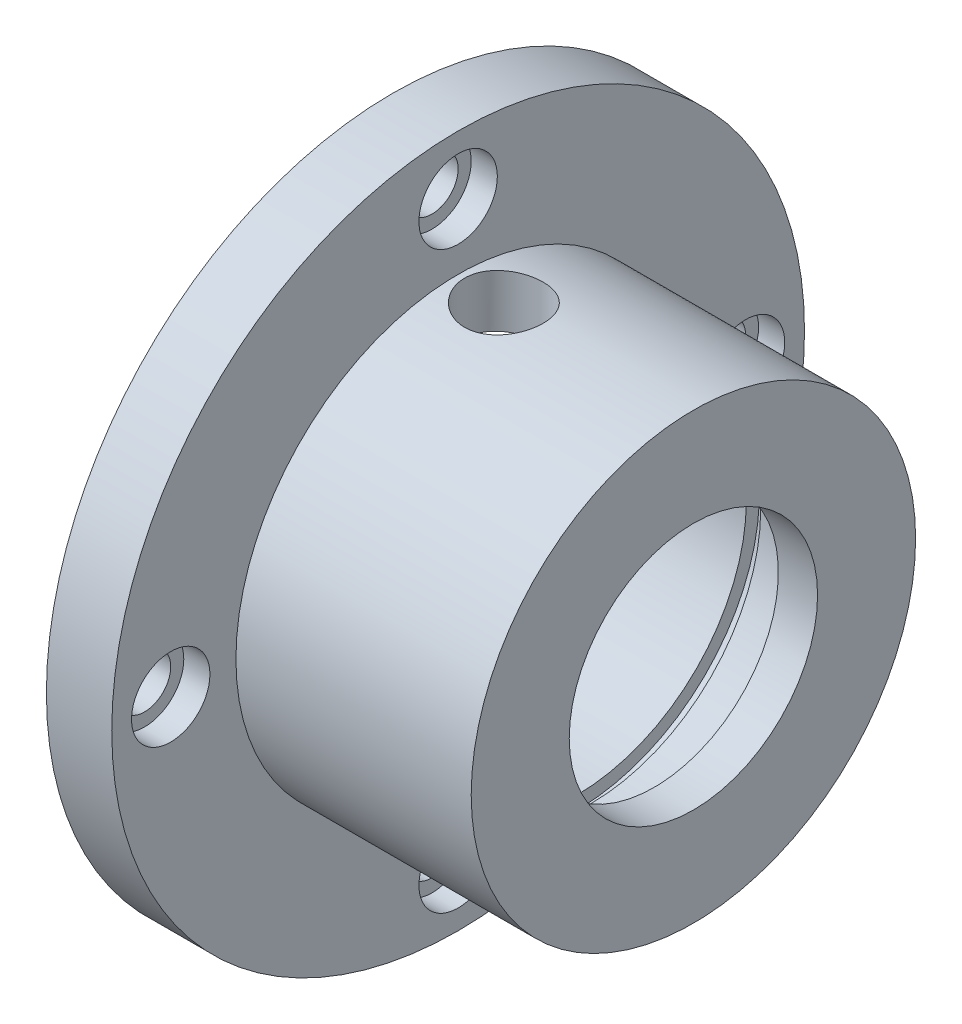
ISO-10303-21;
HEADER;
FILE_DESCRIPTION(('STEP AP214'),'2;1');
FILE_NAME('part.step','',(''),(''),'','','');
FILE_SCHEMA(('AUTOMOTIVE_DESIGN { 1 0 10303 214 1 1 1 1 }'));
ENDSEC;
DATA;
#1=APPLICATION_CONTEXT('core data for automotive mechanical design processes');
#2=APPLICATION_PROTOCOL_DEFINITION('international standard','automotive_design',2000,#1);
#3=PRODUCT_CONTEXT('',#1,'mechanical');
#4=PRODUCT('Part','Part','',(#3));
#5=PRODUCT_RELATED_PRODUCT_CATEGORY('part','',(#4));
#6=PRODUCT_DEFINITION_FORMATION('','',#4);
#7=PRODUCT_DEFINITION_CONTEXT('part definition',#1,'design');
#8=PRODUCT_DEFINITION('design','',#6,#7);
#9=PRODUCT_DEFINITION_SHAPE('','',#8);
#10=(LENGTH_UNIT() NAMED_UNIT(*) SI_UNIT(.MILLI.,.METRE.));
#11=(NAMED_UNIT(*) PLANE_ANGLE_UNIT() SI_UNIT($,.RADIAN.));
#12=(NAMED_UNIT(*) SI_UNIT($,.STERADIAN.) SOLID_ANGLE_UNIT());
#13=UNCERTAINTY_MEASURE_WITH_UNIT(LENGTH_MEASURE(1.E-05),#10,'distance_accuracy_value','');
#14=(GEOMETRIC_REPRESENTATION_CONTEXT(3) GLOBAL_UNCERTAINTY_ASSIGNED_CONTEXT((#13)) GLOBAL_UNIT_ASSIGNED_CONTEXT((#10,
#11,#12)) REPRESENTATION_CONTEXT('',''));
#15=CARTESIAN_POINT('',(0.,0.,0.));
#16=DIRECTION('',(0.,0.,1.));
#17=DIRECTION('',(1.,0.,0.));
#18=AXIS2_PLACEMENT_3D('',#15,#16,#17);
#19=CARTESIAN_POINT('',(11.5,-21.9876704063217,0.));
#20=DIRECTION('',(-1.,0.,0.));
#21=DIRECTION('',(0.,0.,1.));
#22=AXIS2_PLACEMENT_3D('',#19,#20,#21);
#23=CYLINDRICAL_SURFACE('',#22,2.);
#24=CARTESIAN_POINT('',(-11.5,-21.9876704063217,0.));
#25=DIRECTION('',(1.,0.,0.));
#26=DIRECTION('',(0.,0.,-1.));
#27=AXIS2_PLACEMENT_3D('',#24,#25,#26);
#28=CIRCLE('',#27,2.);
#29=CARTESIAN_POINT('',(-11.5,-21.9876704063217,-2.));
#30=VERTEX_POINT('',#29);
#31=EDGE_CURVE('E180',#30,#30,#28,.T.);
#32=ORIENTED_EDGE('',*,*,#31,.F.);
#33=EDGE_LOOP('',(#32));
#34=FACE_BOUND('',#33,.T.);
#35=CARTESIAN_POINT('',(-8.5,-21.9876704063217,0.));
#36=DIRECTION('',(1.,0.,0.));
#37=DIRECTION('',(0.,0.,-1.));
#38=AXIS2_PLACEMENT_3D('',#35,#36,#37);
#39=CIRCLE('',#38,2.);
#40=CARTESIAN_POINT('',(-8.5,-21.9876704063217,-2.));
#41=VERTEX_POINT('',#40);
#42=EDGE_CURVE('E175',#41,#41,#39,.T.);
#43=ORIENTED_EDGE('',*,*,#42,.T.);
#44=EDGE_LOOP('',(#43));
#45=FACE_BOUND('',#44,.T.);
#46=ADVANCED_FACE('F171',(#34,#45),#23,.F.);
#47=CARTESIAN_POINT('',(11.5,0.,21.9876704063218));
#48=DIRECTION('',(-1.,0.,0.));
#49=DIRECTION('',(0.,0.,1.));
#50=AXIS2_PLACEMENT_3D('',#47,#48,#49);
#51=CYLINDRICAL_SURFACE('',#50,2.);
#52=CARTESIAN_POINT('',(-11.5,0.,21.9876704063218));
#53=DIRECTION('',(1.,0.,0.));
#54=DIRECTION('',(0.,0.,-1.));
#55=AXIS2_PLACEMENT_3D('',#52,#53,#54);
#56=CIRCLE('',#55,2.);
#57=CARTESIAN_POINT('',(-11.5,0.,19.9876704063218));
#58=VERTEX_POINT('',#57);
#59=EDGE_CURVE('E187',#58,#58,#56,.T.);
#60=ORIENTED_EDGE('',*,*,#59,.F.);
#61=EDGE_LOOP('',(#60));
#62=FACE_BOUND('',#61,.T.);
#63=CARTESIAN_POINT('',(-8.5,0.,21.9876704063218));
#64=DIRECTION('',(1.,0.,0.));
#65=DIRECTION('',(0.,0.,-1.));
#66=AXIS2_PLACEMENT_3D('',#63,#64,#65);
#67=CIRCLE('',#66,2.);
#68=CARTESIAN_POINT('',(-8.5,0.,19.9876704063218));
#69=VERTEX_POINT('',#68);
#70=EDGE_CURVE('E666',#69,#69,#67,.T.);
#71=ORIENTED_EDGE('',*,*,#70,.T.);
#72=EDGE_LOOP('',(#71));
#73=FACE_BOUND('',#72,.T.);
#74=ADVANCED_FACE('F260',(#62,#73),#51,.F.);
#75=CARTESIAN_POINT('',(11.5,21.9876704063218,0.));
#76=DIRECTION('',(-1.,0.,0.));
#77=DIRECTION('',(0.,0.,1.));
#78=AXIS2_PLACEMENT_3D('',#75,#76,#77);
#79=CYLINDRICAL_SURFACE('',#78,2.);
#80=CARTESIAN_POINT('',(-11.5,21.9876704063218,0.));
#81=DIRECTION('',(1.,0.,0.));
#82=DIRECTION('',(0.,0.,-1.));
#83=AXIS2_PLACEMENT_3D('',#80,#81,#82);
#84=CIRCLE('',#83,2.);
#85=CARTESIAN_POINT('',(-11.5,21.9876704063218,-2.));
#86=VERTEX_POINT('',#85);
#87=EDGE_CURVE('E293',#86,#86,#84,.T.);
#88=ORIENTED_EDGE('',*,*,#87,.F.);
#89=EDGE_LOOP('',(#88));
#90=FACE_BOUND('',#89,.T.);
#91=CARTESIAN_POINT('',(-8.5,21.9876704063218,0.));
#92=DIRECTION('',(1.,0.,0.));
#93=DIRECTION('',(0.,0.,-1.));
#94=AXIS2_PLACEMENT_3D('',#91,#92,#93);
#95=CIRCLE('',#94,2.);
#96=CARTESIAN_POINT('',(-8.5,21.9876704063218,-2.));
#97=VERTEX_POINT('',#96);
#98=EDGE_CURVE('E596',#97,#97,#95,.T.);
#99=ORIENTED_EDGE('',*,*,#98,.T.);
#100=EDGE_LOOP('',(#99));
#101=FACE_BOUND('',#100,.T.);
#102=ADVANCED_FACE('F256',(#90,#101),#79,.F.);
#103=CARTESIAN_POINT('',(11.5,0.,-21.9876704063218));
#104=DIRECTION('',(-1.,0.,0.));
#105=DIRECTION('',(0.,0.,1.));
#106=AXIS2_PLACEMENT_3D('',#103,#104,#105);
#107=CYLINDRICAL_SURFACE('',#106,2.);
#108=CARTESIAN_POINT('',(-11.5,0.,-21.9876704063218));
#109=DIRECTION('',(1.,0.,0.));
#110=DIRECTION('',(0.,0.,-1.));
#111=AXIS2_PLACEMENT_3D('',#108,#109,#110);
#112=CIRCLE('',#111,2.);
#113=CARTESIAN_POINT('',(-11.5,0.,-23.9876704063218));
#114=VERTEX_POINT('',#113);
#115=EDGE_CURVE('E296',#114,#114,#112,.T.);
#116=ORIENTED_EDGE('',*,*,#115,.F.);
#117=EDGE_LOOP('',(#116));
#118=FACE_BOUND('',#117,.T.);
#119=CARTESIAN_POINT('',(-8.5,0.,-21.9876704063218));
#120=DIRECTION('',(1.,0.,0.));
#121=DIRECTION('',(0.,0.,-1.));
#122=AXIS2_PLACEMENT_3D('',#119,#120,#121);
#123=CIRCLE('',#122,2.);
#124=CARTESIAN_POINT('',(-8.5,0.,-23.9876704063218));
#125=VERTEX_POINT('',#124);
#126=EDGE_CURVE('E216',#125,#125,#123,.T.);
#127=ORIENTED_EDGE('',*,*,#126,.T.);
#128=EDGE_LOOP('',(#127));
#129=FACE_BOUND('',#128,.T.);
#130=ADVANCED_FACE('F251',(#118,#129),#107,.F.);
#131=CARTESIAN_POINT('',(-6.5,0.,0.));
#132=DIRECTION('',(1.,0.,0.));
#133=DIRECTION('',(0.,0.,-1.));
#134=AXIS2_PLACEMENT_3D('',#131,#132,#133);
#135=CYLINDRICAL_SURFACE('',#134,17.);
#136=CARTESIAN_POINT('',(11.5,0.,0.));
#137=DIRECTION('',(1.,0.,0.));
#138=DIRECTION('',(0.,0.,-1.));
#139=AXIS2_PLACEMENT_3D('',#136,#137,#138);
#140=CIRCLE('',#139,17.);
#141=CARTESIAN_POINT('',(11.5,0.,-17.));
#142=VERTEX_POINT('',#141);
#143=EDGE_CURVE('E308',#142,#142,#140,.T.);
#144=ORIENTED_EDGE('',*,*,#143,.F.);
#145=EDGE_LOOP('',(#144));
#146=FACE_BOUND('',#145,.T.);
#147=CARTESIAN_POINT('',(-6.5,0.,0.));
#148=DIRECTION('',(1.,0.,0.));
#149=DIRECTION('',(0.,0.,-1.));
#150=AXIS2_PLACEMENT_3D('',#147,#148,#149);
#151=CIRCLE('',#150,17.);
#152=CARTESIAN_POINT('',(-6.5,0.,-17.));
#153=VERTEX_POINT('',#152);
#154=EDGE_CURVE('E305',#153,#153,#151,.T.);
#155=ORIENTED_EDGE('',*,*,#154,.T.);
#156=EDGE_LOOP('',(#155));
#157=FACE_BOUND('',#156,.T.);
#158=CARTESIAN_POINT('',(-3.,16.7332005306815,-3.));
#159=CARTESIAN_POINT('',(-2.83290242517745,16.733203659137,-2.99999341706779));
#160=CARTESIAN_POINT('',(-2.66571728359335,16.7357306336792,-2.98599188006115));
#161=CARTESIAN_POINT('',(-2.33604853853598,16.7455547560881,-2.93038611619624));
#162=CARTESIAN_POINT('',(-2.17356924605811,16.7528561418772,-2.88875736603643));
#163=CARTESIAN_POINT('',(-1.85813046315929,16.7713769744464,-2.77920470143951));
#164=CARTESIAN_POINT('',(-1.70516273825064,16.7825929749641,-2.71130391011432));
#165=CARTESIAN_POINT('',(-1.41280390580784,16.8076752031184,-2.55119395060397));
#166=CARTESIAN_POINT('',(-1.27341148708122,16.8215411744195,-2.45898713324998));
#167=CARTESIAN_POINT('',(-1.01060791050012,16.8505319667316,-2.25179739075806));
#168=CARTESIAN_POINT('',(-0.887368331806502,16.8656678757378,-2.13659835160851));
#169=CARTESIAN_POINT('',(-0.661861174170796,16.8953948741519,-1.88716133428236));
#170=CARTESIAN_POINT('',(-0.559594898043314,16.9099859296687,-1.7529221742517));
#171=CARTESIAN_POINT('',(-0.378287035302201,16.9370972325124,-1.46809659328413));
#172=CARTESIAN_POINT('',(-0.299406108837018,16.9496029076749,-1.31740639730191));
#173=CARTESIAN_POINT('',(-0.168141843225435,16.9710106727515,-1.0046561208221));
#174=CARTESIAN_POINT('',(-0.11575657406108,16.9799130251322,-0.842596869457892));
#175=CARTESIAN_POINT('',(-0.0394981276670255,16.9930327949023,-0.51348405487888));
#176=CARTESIAN_POINT('',(-0.0153361926544865,16.99729762782,-0.346499320678272));
#177=CARTESIAN_POINT('',(0.00468845854208651,17.0008249757298,-0.0107952857006706));
#178=CARTESIAN_POINT('',(0.00055332042626999,17.0000878700071,0.157923882589586));
#179=CARTESIAN_POINT('',(-0.035675306623233,16.9937317070067,0.490330439822313));
#180=CARTESIAN_POINT('',(-0.06745796453603,16.9881669273875,0.654052892885598));
#181=CARTESIAN_POINT('',(-0.157589006441779,16.9728413393235,0.97380383078362));
#182=CARTESIAN_POINT('',(-0.215938274329761,16.9630803912691,1.12983205943314));
#183=CARTESIAN_POINT('',(-0.357849279757668,16.9403675397274,1.43067945594811));
#184=CARTESIAN_POINT('',(-0.441537345358246,16.9273997089122,1.57543778282086));
#185=CARTESIAN_POINT('',(-0.631657563585156,16.8997108448691,1.84897334841093));
#186=CARTESIAN_POINT('',(-0.738091773558185,16.8849896531063,1.97774913987089));
#187=CARTESIAN_POINT('',(-0.972401978770558,16.8551920631541,2.21750308120658));
#188=CARTESIAN_POINT('',(-1.10054977994146,16.8401135567061,2.32821549831622));
#189=CARTESIAN_POINT('',(-1.37373847473942,16.8114932894814,2.52661268493801));
#190=CARTESIAN_POINT('',(-1.51877956304375,16.7979515464179,2.61429718903989));
#191=CARTESIAN_POINT('',(-1.82196590926801,16.7739360187751,2.76421240007642));
#192=CARTESIAN_POINT('',(-1.98012883323353,16.763466459187,2.82640809993052));
#193=CARTESIAN_POINT('',(-2.30488439069899,16.7468480678056,2.923271922403));
#194=CARTESIAN_POINT('',(-2.47147618397034,16.7406988062511,2.95794278309596));
#195=CARTESIAN_POINT('',(-2.80597444721306,16.7335012949974,2.99839229030452));
#196=CARTESIAN_POINT('',(-2.97383354662812,16.732385932103,3.00455109542123));
#197=CARTESIAN_POINT('',(-3.30818284539117,16.735203364457,2.988817469486));
#198=CARTESIAN_POINT('',(-3.47467310401107,16.7391359399547,2.9669262595295));
#199=CARTESIAN_POINT('',(-3.80033188093181,16.7515439079533,2.89603917366235));
#200=CARTESIAN_POINT('',(-3.95954445821164,16.7599864132377,2.84723943756168));
#201=CARTESIAN_POINT('',(-4.26753258967659,16.7804350541278,2.72412734478129));
#202=CARTESIAN_POINT('',(-4.41630745160447,16.7924414258231,2.64981329784697));
#203=CARTESIAN_POINT('',(-4.70088108970731,16.8188195101243,2.47689505257512));
#204=CARTESIAN_POINT('',(-4.83653061780971,16.8332142870081,2.37804881804717));
#205=CARTESIAN_POINT('',(-5.08945442639291,16.8626809908302,2.15920160851684));
#206=CARTESIAN_POINT('',(-5.20672724975834,16.8777529713432,2.03919895759332));
#207=CARTESIAN_POINT('',(-5.42097151754292,16.9070896901565,1.77975481037973));
#208=CARTESIAN_POINT('',(-5.51768844803103,16.9213428734784,1.64010163284743));
#209=CARTESIAN_POINT('',(-5.68628661620563,16.9472466525071,1.3463081734332));
#210=CARTESIAN_POINT('',(-5.7581687299371,16.9588973400115,1.19216840280802));
#211=CARTESIAN_POINT('',(-5.87466757528012,16.9782334307841,0.874509086642462));
#212=CARTESIAN_POINT('',(-5.91941373570498,16.9859376296005,0.711038201693319));
#213=CARTESIAN_POINT('',(-5.98078566857961,16.9965924853723,0.378753976094074));
#214=CARTESIAN_POINT('',(-5.99741404793107,16.9995435830037,0.209941132194942));
#215=CARTESIAN_POINT('',(-6.00199617685697,17.0003523424479,-0.125785797667699));
#216=CARTESIAN_POINT('',(-5.99033585470446,16.998278556654,-0.292694575575972));
#217=CARTESIAN_POINT('',(-5.93951111217844,16.9894116421764,-0.6221359821573));
#218=CARTESIAN_POINT('',(-5.90034689340248,16.9826185480842,-0.784668642897266));
#219=CARTESIAN_POINT('',(-5.7957809492101,16.965074633354,-1.10057077006559));
#220=CARTESIAN_POINT('',(-5.73041583804355,16.9543293374119,-1.25395268193512));
#221=CARTESIAN_POINT('',(-5.57534797368827,16.9300495065003,-1.54763086574851));
#222=CARTESIAN_POINT('',(-5.48564384478414,16.916514813876,-1.68792639740778));
#223=CARTESIAN_POINT('',(-5.28309416335656,16.8879355033809,-1.95338412231491));
#224=CARTESIAN_POINT('',(-5.16996767677077,16.8728738083157,-2.07833014278401));
#225=CARTESIAN_POINT('',(-4.92437146490511,16.8430514055019,-2.30760043049162));
#226=CARTESIAN_POINT('',(-4.79189721104744,16.8282907691441,-2.41191985633483));
#227=CARTESIAN_POINT('',(-4.51009515247276,16.8006127610803,-2.59775561790147));
#228=CARTESIAN_POINT('',(-4.36064031467871,16.7877111766405,-2.67908171730508));
#229=CARTESIAN_POINT('',(-4.05001730240621,16.7654000051509,-2.81534545371831));
#230=CARTESIAN_POINT('',(-3.8888607139775,16.7559870188903,-2.87030879344953));
#231=CARTESIAN_POINT('',(-3.60595283314428,16.743749817072,-2.94069751613137));
#232=CARTESIAN_POINT('',(-3.48588988570537,16.7398165049557,-2.96289917401039));
#233=CARTESIAN_POINT('',(-3.24390015090383,16.7345407484587,-2.9925526562456));
#234=CARTESIAN_POINT('',(-3.12197340462215,16.7331982470555,-3.00000480523225));
#235=CARTESIAN_POINT('',(-3.,16.7332005306815,-3.));
#236=B_SPLINE_CURVE_WITH_KNOTS('',3,(#158,#159,#160,#161,#162,#163,#164,#165,#166,#167,#168,
#169,#170,#171,#172,#173,#174,#175,#176,#177,#178,#179,#180,#181,#182,#183,#184,#185,#186,#187,
#188,#189,#190,#191,#192,#193,#194,#195,#196,#197,#198,#199,#200,#201,#202,#203,#204,#205,#206,
#207,#208,#209,#210,#211,#212,#213,#214,#215,#216,#217,#218,#219,#220,#221,#222,#223,#224,#225,
#226,#227,#228,#229,#230,#231,#232,#233,#234,#235),.UNSPECIFIED.,.T.,.F.,(4,2,2,2,2,2,2,2,2,2,2,
2,2,2,2,2,2,2,2,2,2,2,2,2,2,2,2,2,2,2,2,2,2,2,2,2,2,2,4),(0.,0.500846543953231,1.00213826013799,
1.50298976868477,2.00379285361821,2.50954594710764,3.01533044733788,3.52451324479758,
4.03365894661123,4.53754855435206,5.04139995375876,5.53965889297026,6.03793441091674,
6.53873619993847,7.0395833047412,7.54723879028646,8.05490012660333,8.56325638208416,
9.07156206172708,9.57307047019078,10.0745570473354,10.5724356393645,11.07034722088,
11.5733814202243,12.0764554857135,12.5854359093522,13.0943983769382,13.6009137808448,
14.107382221292,14.6069801177485,15.1065743523003,15.6054728529528,16.1043995587445,
16.609698668765,17.1151162402339,17.6246005916944,18.1335871998258,18.4991897696583,
18.8647842926434),.UNSPECIFIED.);
#237=CARTESIAN_POINT('',(-3.,16.7332005306815,-3.));
#238=VERTEX_POINT('',#237);
#239=EDGE_CURVE('E215',#238,#238,#236,.T.);
#240=ORIENTED_EDGE('',*,*,#239,.T.);
#241=EDGE_LOOP('',(#240));
#242=FACE_BOUND('',#241,.T.);
#243=ADVANCED_FACE('F247',(#146,#157,#242),#135,.T.);
#244=CARTESIAN_POINT('',(8.5,0.,0.));
#245=DIRECTION('',(-1.,0.,0.));
#246=DIRECTION('',(0.,0.,1.));
#247=AXIS2_PLACEMENT_3D('',#244,#245,#246);
#248=CYLINDRICAL_SURFACE('',#247,13.);
#249=CARTESIAN_POINT('',(2.55,0.,0.));
#250=DIRECTION('',(-1.,0.,0.));
#251=DIRECTION('',(0.,0.,1.));
#252=AXIS2_PLACEMENT_3D('',#249,#250,#251);
#253=CIRCLE('',#252,13.);
#254=CARTESIAN_POINT('',(2.55,0.,13.));
#255=VERTEX_POINT('',#254);
#256=EDGE_CURVE('E197',#255,#255,#253,.F.);
#257=ORIENTED_EDGE('',*,*,#256,.T.);
#258=EDGE_LOOP('',(#257));
#259=FACE_BOUND('',#258,.T.);
#260=CARTESIAN_POINT('',(-11.5,0.,0.));
#261=DIRECTION('',(-1.,0.,0.));
#262=DIRECTION('',(0.,0.,1.));
#263=AXIS2_PLACEMENT_3D('',#260,#261,#262);
#264=CIRCLE('',#263,13.);
#265=CARTESIAN_POINT('',(-11.5,0.,13.));
#266=VERTEX_POINT('',#265);
#267=EDGE_CURVE('E195',#266,#266,#264,.T.);
#268=ORIENTED_EDGE('',*,*,#267,.T.);
#269=EDGE_LOOP('',(#268));
#270=FACE_BOUND('',#269,.T.);
#271=CARTESIAN_POINT('',(-3.,12.6491106406735,-3.));
#272=CARTESIAN_POINT('',(-2.83391407036858,12.6491139729391,-2.9999946245021));
#273=CARTESIAN_POINT('',(-2.66776551956176,12.6524174299822,-2.98616079030694));
#274=CARTESIAN_POINT('',(-2.34021047583184,12.6652465923009,-2.93126165669304));
#275=CARTESIAN_POINT('',(-2.17880723762123,12.674776468694,-2.89017810223513));
#276=CARTESIAN_POINT('',(-1.8655281614392,12.6989229865282,-2.78215616244894));
#277=CARTESIAN_POINT('',(-1.71364143115851,12.713533682283,-2.71524798764163));
#278=CARTESIAN_POINT('',(-1.42324039311133,12.7461883447142,-2.5575647638114));
#279=CARTESIAN_POINT('',(-1.2847261269739,12.764232322078,-2.46678964049286));
#280=CARTESIAN_POINT('',(-1.02239954560618,12.8020993500835,-2.26213062702366));
#281=CARTESIAN_POINT('',(-0.898875138877558,12.8219473065538,-2.1478822444478));
#282=CARTESIAN_POINT('',(-0.672561710896972,12.860968641196,-1.90030604476977));
#283=CARTESIAN_POINT('',(-0.569774417353289,12.8801419630512,-1.76697663951672));
#284=CARTESIAN_POINT('',(-0.386699559095736,12.915926594876,-1.48307705159748));
#285=CARTESIAN_POINT('',(-0.306691122261389,12.9325050857704,-1.33232237777388));
#286=CARTESIAN_POINT('',(-0.173254299839675,12.9609497350116,-1.01905965401954));
#287=CARTESIAN_POINT('',(-0.11982258703461,12.9728164831977,-0.856553078262879));
#288=CARTESIAN_POINT('',(-0.0419676722167105,12.990324560775,-0.527396276574475));
#289=CARTESIAN_POINT('',(-0.0170565524955242,12.9960704797887,-0.360867114923414));
#290=CARTESIAN_POINT('',(0.00457778732886047,13.0010526406593,-0.0259008572240832));
#291=CARTESIAN_POINT('',(0.00130458135734171,13.000289707874,0.142535994213679));
#292=CARTESIAN_POINT('',(-0.0329780326761776,12.9924192928671,0.473165243537533));
#293=CARTESIAN_POINT('',(-0.0634612632326135,12.9854321768116,0.635415490640888));
#294=CARTESIAN_POINT('',(-0.150457450654159,12.9660366959477,0.952433164284375));
#295=CARTESIAN_POINT('',(-0.206971667941309,12.9536280686309,1.10720022808729));
#296=CARTESIAN_POINT('',(-0.344876150258259,12.9245937060633,1.40629128250779));
#297=CARTESIAN_POINT('',(-0.426461315800089,12.9079351104055,1.55052208796757));
#298=CARTESIAN_POINT('',(-0.612045586368613,12.8722203152567,1.82343497204499));
#299=CARTESIAN_POINT('',(-0.716048063756011,12.8531637552062,1.95211470667813));
#300=CARTESIAN_POINT('',(-0.946363506307277,12.8142215416329,2.1934058842547));
#301=CARTESIAN_POINT('',(-1.0731368244587,12.7943269062359,2.30557688423932));
#302=CARTESIAN_POINT('',(-1.34390246442598,12.7563601191761,2.50715545224223));
#303=CARTESIAN_POINT('',(-1.48789536614344,12.7382880289286,2.5965622533162));
#304=CARTESIAN_POINT('',(-1.78978051408819,12.7059853658082,2.75030147334197));
#305=CARTESIAN_POINT('',(-1.94772101517499,12.6917688823564,2.81454229910148));
#306=CARTESIAN_POINT('',(-2.27256355444819,12.6689761200522,2.91543265644024));
#307=CARTESIAN_POINT('',(-2.4394639854692,12.6603988333148,2.95208711865724));
#308=CARTESIAN_POINT('',(-2.77344184000971,12.6500634806979,2.99606364387658));
#309=CARTESIAN_POINT('',(-2.9404297975397,12.6481554983084,3.00403068516923));
#310=CARTESIAN_POINT('',(-3.2733480744854,12.6509690118016,2.99215969056544));
#311=CARTESIAN_POINT('',(-3.43927847452839,12.6556899960744,2.97232380044158));
#312=CARTESIAN_POINT('',(-3.76307109043335,12.6710871477522,2.90597189831615));
#313=CARTESIAN_POINT('',(-3.92101183761011,12.6816823107987,2.85981855993657));
#314=CARTESIAN_POINT('',(-4.2269175658547,12.7075595201458,2.7425380227221));
#315=CARTESIAN_POINT('',(-4.37488150315387,12.7228420559117,2.67140821567947));
#316=CARTESIAN_POINT('',(-4.65940307375868,12.7566963286292,2.50479935819412));
#317=CARTESIAN_POINT('',(-4.7957243290224,12.775319516353,2.40892731507744));
#318=CARTESIAN_POINT('',(-5.0505807258662,12.8136246309507,2.19606317641424));
#319=CARTESIAN_POINT('',(-5.1691133915019,12.833306704691,2.07906814580117));
#320=CARTESIAN_POINT('',(-5.38757162939905,12.8720112725971,1.82434490857929));
#321=CARTESIAN_POINT('',(-5.4870550442548,12.8910112902544,1.68623348016341));
#322=CARTESIAN_POINT('',(-5.66141080499818,12.9257797692582,1.39488634866838));
#323=CARTESIAN_POINT('',(-5.73628436262695,12.9415483896978,1.24165139072541));
#324=CARTESIAN_POINT('',(-5.85869947583708,12.9679835289197,0.925410504785927));
#325=CARTESIAN_POINT('',(-5.90642440056004,12.9786841937062,0.762478543893019));
#326=CARTESIAN_POINT('',(-5.97375303694443,12.9939261237968,0.430632225011116));
#327=CARTESIAN_POINT('',(-5.99336132667247,12.99846839183,0.261718845531956));
#328=CARTESIAN_POINT('',(-6.00367490456574,13.0008478161074,-0.0731147580789177));
#329=CARTESIAN_POINT('',(-5.99503739400405,12.9988374378214,-0.239013989351583));
#330=CARTESIAN_POINT('',(-5.95058762898657,12.9886683469743,-0.566928369656013));
#331=CARTESIAN_POINT('',(-5.91477597456981,12.980509770173,-0.728943604369786));
#332=CARTESIAN_POINT('',(-5.81732403683244,12.9589769318438,-1.04391562233924));
#333=CARTESIAN_POINT('',(-5.75578656979892,12.9456234469743,-1.19690572846382));
#334=CARTESIAN_POINT('',(-5.60872663708603,12.9151190396146,-1.49047181383704));
#335=CARTESIAN_POINT('',(-5.52320156923543,12.8979677051768,-1.63104644408015));
#336=CARTESIAN_POINT('',(-5.32850248790651,12.8612836290516,-1.89896480731369));
#337=CARTESIAN_POINT('',(-5.21887215854183,12.8417086566635,-2.0259711704593));
#338=CARTESIAN_POINT('',(-4.9799824228948,12.8025963604477,-2.26000832156021));
#339=CARTESIAN_POINT('',(-4.85071821408086,12.7830590470187,-2.36703420788799));
#340=CARTESIAN_POINT('',(-4.57385603874387,12.7458991234253,-2.5596581660751));
#341=CARTESIAN_POINT('',(-4.42600839044306,12.7283102829991,-2.64490430932249));
#342=CARTESIAN_POINT('',(-4.11770431683566,12.6974733667531,-2.78920331982028));
#343=CARTESIAN_POINT('',(-3.95725814255476,12.6842218062867,-2.84827722786392));
#344=CARTESIAN_POINT('',(-3.66400176210906,12.6658719164676,-2.92864765692709));
#345=CARTESIAN_POINT('',(-3.53271827946382,12.6596301542599,-2.95535096878448));
#346=CARTESIAN_POINT('',(-3.26763665088119,12.6512482980183,-2.99102876898443));
#347=CARTESIAN_POINT('',(-3.1338386578423,12.6491079554012,-3.00000433179033));
#348=CARTESIAN_POINT('',(-3.,12.6491106406735,-3.));
#349=B_SPLINE_CURVE_WITH_KNOTS('',3,(#271,#272,#273,#274,#275,#276,#277,#278,#279,#280,#281,
#282,#283,#284,#285,#286,#287,#288,#289,#290,#291,#292,#293,#294,#295,#296,#297,#298,#299,#300,
#301,#302,#303,#304,#305,#306,#307,#308,#309,#310,#311,#312,#313,#314,#315,#316,#317,#318,#319,
#320,#321,#322,#323,#324,#325,#326,#327,#328,#329,#330,#331,#332,#333,#334,#335,#336,#337,#338,
#339,#340,#341,#342,#343,#344,#345,#346,#347,#348),.UNSPECIFIED.,.T.,.F.,(4,2,2,2,2,2,2,2,2,2,2,
2,2,2,2,2,2,2,2,2,2,2,2,2,2,2,2,2,2,2,2,2,2,2,2,2,2,2,4),(0.,0.497766931606995,
0.995867662786753,1.49338745625111,1.99090879846697,2.49683528598289,3.00280390726787,
3.51472913247548,4.02659025212784,4.52955730661948,5.0324605831014,5.52584465394859,
6.01925261699573,6.51659773888752,7.01401773145073,7.52294169566517,8.03188280367244,
8.54265939854458,9.05334467826894,9.55247393504074,10.0515646721731,10.5439382810322,
11.0363633220925,11.5371508785039,12.0380080736258,12.549364908912,13.0606965622168,
13.5685322375916,14.0762852156718,14.5723090071665,15.068321846155,15.56237098086,
16.0564737306814,16.5608887352403,17.0654273211741,17.5776655194299,18.0894911605436,
18.4906358954932,18.8917563166655),.UNSPECIFIED.);
#350=CARTESIAN_POINT('',(-3.,12.6491106406735,-3.));
#351=VERTEX_POINT('',#350);
#352=EDGE_CURVE('E206',#351,#351,#349,.T.);
#353=ORIENTED_EDGE('',*,*,#352,.F.);
#354=EDGE_LOOP('',(#353));
#355=FACE_BOUND('',#354,.T.);
#356=ADVANCED_FACE('F218',(#259,#270,#355),#248,.F.);
#357=CARTESIAN_POINT('',(8.5,0.,0.));
#358=DIRECTION('',(-1.,0.,0.));
#359=DIRECTION('',(0.,0.,1.));
#360=AXIS2_PLACEMENT_3D('',#357,#358,#359);
#361=CIRCLE('',#360,13.);
#362=CARTESIAN_POINT('',(8.5,0.,13.));
#363=VERTEX_POINT('',#362);
#364=EDGE_CURVE('E315',#363,#363,#361,.T.);
#365=ORIENTED_EDGE('',*,*,#364,.F.);
#366=EDGE_LOOP('',(#365));
#367=FACE_BOUND('',#366,.T.);
#368=CARTESIAN_POINT('',(3.65,0.,0.));
#369=DIRECTION('',(-1.,0.,0.));
#370=DIRECTION('',(0.,0.,1.));
#371=AXIS2_PLACEMENT_3D('',#368,#369,#370);
#372=CIRCLE('',#371,13.);
#373=CARTESIAN_POINT('',(3.65,0.,13.));
#374=VERTEX_POINT('',#373);
#375=EDGE_CURVE('E201',#374,#374,#372,.F.);
#376=ORIENTED_EDGE('',*,*,#375,.F.);
#377=EDGE_LOOP('',(#376));
#378=FACE_BOUND('',#377,.T.);
#379=ADVANCED_FACE('F280',(#367,#378),#248,.F.);
#380=CARTESIAN_POINT('',(11.5,0.,0.));
#381=DIRECTION('',(-1.,0.,0.));
#382=DIRECTION('',(0.,0.,1.));
#383=AXIS2_PLACEMENT_3D('',#380,#381,#382);
#384=CYLINDRICAL_SURFACE('',#383,26.5);
#385=CARTESIAN_POINT('',(-11.5,0.,0.));
#386=DIRECTION('',(1.,0.,0.));
#387=DIRECTION('',(0.,0.,-1.));
#388=AXIS2_PLACEMENT_3D('',#385,#386,#387);
#389=CIRCLE('',#388,26.5);
#390=CARTESIAN_POINT('',(-11.5,0.,-26.5));
#391=VERTEX_POINT('',#390);
#392=EDGE_CURVE('E11',#391,#391,#389,.T.);
#393=ORIENTED_EDGE('',*,*,#392,.T.);
#394=EDGE_LOOP('',(#393));
#395=FACE_BOUND('',#394,.T.);
#396=CARTESIAN_POINT('',(-6.5,0.,0.));
#397=DIRECTION('',(1.,0.,0.));
#398=DIRECTION('',(0.,0.,-1.));
#399=AXIS2_PLACEMENT_3D('',#396,#397,#398);
#400=CIRCLE('',#399,26.5);
#401=CARTESIAN_POINT('',(-6.5,0.,-26.5));
#402=VERTEX_POINT('',#401);
#403=EDGE_CURVE('E298',#402,#402,#400,.T.);
#404=ORIENTED_EDGE('',*,*,#403,.F.);
#405=EDGE_LOOP('',(#404));
#406=FACE_BOUND('',#405,.T.);
#407=ADVANCED_FACE('F173',(#395,#406),#384,.T.);
#408=CARTESIAN_POINT('',(-11.5,0.,0.));
#409=DIRECTION('',(1.,0.,0.));
#410=DIRECTION('',(0.,0.,-1.));
#411=AXIS2_PLACEMENT_3D('',#408,#409,#410);
#412=PLANE('',#411);
#413=ORIENTED_EDGE('',*,*,#267,.F.);
#414=EDGE_LOOP('',(#413));
#415=FACE_BOUND('',#414,.T.);
#416=ORIENTED_EDGE('',*,*,#392,.F.);
#417=EDGE_LOOP('',(#416));
#418=FACE_BOUND('',#417,.T.);
#419=ORIENTED_EDGE('',*,*,#31,.T.);
#420=EDGE_LOOP('',(#419));
#421=FACE_BOUND('',#420,.T.);
#422=ORIENTED_EDGE('',*,*,#59,.T.);
#423=EDGE_LOOP('',(#422));
#424=FACE_BOUND('',#423,.T.);
#425=ORIENTED_EDGE('',*,*,#87,.T.);
#426=EDGE_LOOP('',(#425));
#427=FACE_BOUND('',#426,.T.);
#428=ORIENTED_EDGE('',*,*,#115,.T.);
#429=EDGE_LOOP('',(#428));
#430=FACE_BOUND('',#429,.T.);
#431=ADVANCED_FACE('F272',(#415,#418,#421,#424,#427,#430),#412,.F.);
#432=CARTESIAN_POINT('',(-6.5,0.,0.));
#433=DIRECTION('',(1.,0.,0.));
#434=DIRECTION('',(0.,0.,-1.));
#435=AXIS2_PLACEMENT_3D('',#432,#433,#434);
#436=PLANE('',#435);
#437=CARTESIAN_POINT('',(-6.5,21.9876704063218,0.));
#438=DIRECTION('',(1.,0.,0.));
#439=DIRECTION('',(0.,0.,-1.));
#440=AXIS2_PLACEMENT_3D('',#437,#438,#439);
#441=CIRCLE('',#440,3.);
#442=CARTESIAN_POINT('',(-6.5,21.9876704063218,-3.));
#443=VERTEX_POINT('',#442);
#444=EDGE_CURVE('E601',#443,#443,#441,.T.);
#445=ORIENTED_EDGE('',*,*,#444,.F.);
#446=EDGE_LOOP('',(#445));
#447=FACE_BOUND('',#446,.T.);
#448=CARTESIAN_POINT('',(-6.5,6.2223446632159E-13,-21.9876704063224));
#449=DIRECTION('',(1.,0.,0.));
#450=DIRECTION('',(0.,0.,-1.));
#451=AXIS2_PLACEMENT_3D('',#448,#449,#450);
#452=CIRCLE('',#451,3.00000000000049);
#453=CARTESIAN_POINT('',(-6.5,6.2223446632159E-13,-24.9876704063229));
#454=VERTEX_POINT('',#453);
#455=EDGE_CURVE('E614',#454,#454,#452,.T.);
#456=ORIENTED_EDGE('',*,*,#455,.F.);
#457=EDGE_LOOP('',(#456));
#458=FACE_BOUND('',#457,.T.);
#459=CARTESIAN_POINT('',(-6.5,-21.9876704063218,-1.24219210808096E-12));
#460=DIRECTION('',(1.,0.,0.));
#461=DIRECTION('',(0.,0.,-1.));
#462=AXIS2_PLACEMENT_3D('',#459,#460,#461);
#463=CIRCLE('',#462,3.00000000000133);
#464=CARTESIAN_POINT('',(-6.5,-21.9876704063218,-3.00000000000257));
#465=VERTEX_POINT('',#464);
#466=EDGE_CURVE('E622',#465,#465,#463,.T.);
#467=ORIENTED_EDGE('',*,*,#466,.F.);
#468=EDGE_LOOP('',(#467));
#469=FACE_BOUND('',#468,.T.);
#470=CARTESIAN_POINT('',(-6.5,-6.24927179339971E-13,21.9876704063212));
#471=DIRECTION('',(1.,0.,0.));
#472=DIRECTION('',(0.,0.,-1.));
#473=AXIS2_PLACEMENT_3D('',#470,#471,#472);
#474=CIRCLE('',#473,3.000000000001);
#475=CARTESIAN_POINT('',(-6.5,-6.24927179339971E-13,18.9876704063202));
#476=VERTEX_POINT('',#475);
#477=EDGE_CURVE('E244',#476,#476,#474,.T.);
#478=ORIENTED_EDGE('',*,*,#477,.F.);
#479=EDGE_LOOP('',(#478));
#480=FACE_BOUND('',#479,.T.);
#481=ORIENTED_EDGE('',*,*,#154,.F.);
#482=EDGE_LOOP('',(#481));
#483=FACE_BOUND('',#482,.T.);
#484=ORIENTED_EDGE('',*,*,#403,.T.);
#485=EDGE_LOOP('',(#484));
#486=FACE_BOUND('',#485,.T.);
#487=ADVANCED_FACE('F253',(#447,#458,#469,#480,#483,#486),#436,.T.);
#488=CARTESIAN_POINT('',(11.5,0.,0.));
#489=DIRECTION('',(1.,0.,0.));
#490=DIRECTION('',(0.,0.,-1.));
#491=AXIS2_PLACEMENT_3D('',#488,#489,#490);
#492=PLANE('',#491);
#493=CARTESIAN_POINT('',(11.5,0.,0.));
#494=DIRECTION('',(1.,0.,0.));
#495=DIRECTION('',(0.,0.,-1.));
#496=AXIS2_PLACEMENT_3D('',#493,#494,#495);
#497=CIRCLE('',#496,9.5);
#498=CARTESIAN_POINT('',(11.5,0.,-9.5));
#499=VERTEX_POINT('',#498);
#500=EDGE_CURVE('E191',#499,#499,#497,.T.);
#501=ORIENTED_EDGE('',*,*,#500,.F.);
#502=EDGE_LOOP('',(#501));
#503=FACE_BOUND('',#502,.T.);
#504=ORIENTED_EDGE('',*,*,#143,.T.);
#505=EDGE_LOOP('',(#504));
#506=FACE_BOUND('',#505,.T.);
#507=ADVANCED_FACE('F268',(#503,#506),#492,.T.);
#508=CARTESIAN_POINT('',(8.5,0.,0.));
#509=DIRECTION('',(-1.,0.,0.));
#510=DIRECTION('',(0.,0.,1.));
#511=AXIS2_PLACEMENT_3D('',#508,#509,#510);
#512=PLANE('',#511);
#513=CARTESIAN_POINT('',(8.5,0.,0.));
#514=DIRECTION('',(-1.,0.,0.));
#515=DIRECTION('',(0.,0.,1.));
#516=AXIS2_PLACEMENT_3D('',#513,#514,#515);
#517=CIRCLE('',#516,9.5);
#518=CARTESIAN_POINT('',(8.5,0.,9.5));
#519=VERTEX_POINT('',#518);
#520=EDGE_CURVE('E196',#519,#519,#517,.T.);
#521=ORIENTED_EDGE('',*,*,#520,.F.);
#522=EDGE_LOOP('',(#521));
#523=FACE_BOUND('',#522,.T.);
#524=ORIENTED_EDGE('',*,*,#364,.T.);
#525=EDGE_LOOP('',(#524));
#526=FACE_BOUND('',#525,.T.);
#527=ADVANCED_FACE('F270',(#523,#526),#512,.T.);
#528=CARTESIAN_POINT('',(28.5,0.,0.));
#529=DIRECTION('',(-1.,0.,0.));
#530=DIRECTION('',(0.,0.,1.));
#531=AXIS2_PLACEMENT_3D('',#528,#529,#530);
#532=CYLINDRICAL_SURFACE('',#531,9.5);
#533=ORIENTED_EDGE('',*,*,#500,.T.);
#534=EDGE_LOOP('',(#533));
#535=FACE_BOUND('',#534,.T.);
#536=ORIENTED_EDGE('',*,*,#520,.T.);
#537=EDGE_LOOP('',(#536));
#538=FACE_BOUND('',#537,.T.);
#539=ADVANCED_FACE('F347',(#535,#538),#532,.F.);
#540=CARTESIAN_POINT('',(3.65,0.,0.));
#541=DIRECTION('',(-1.,0.,0.));
#542=DIRECTION('',(0.,0.,1.));
#543=AXIS2_PLACEMENT_3D('',#540,#541,#542);
#544=PLANE('',#543);
#545=CARTESIAN_POINT('',(3.65,0.,0.));
#546=DIRECTION('',(-1.,0.,0.));
#547=DIRECTION('',(0.,0.,1.));
#548=AXIS2_PLACEMENT_3D('',#545,#546,#547);
#549=CIRCLE('',#548,14.);
#550=CARTESIAN_POINT('',(3.65,0.,14.));
#551=VERTEX_POINT('',#550);
#552=EDGE_CURVE('E202',#551,#551,#549,.T.);
#553=ORIENTED_EDGE('',*,*,#552,.T.);
#554=EDGE_LOOP('',(#553));
#555=FACE_BOUND('',#554,.T.);
#556=ORIENTED_EDGE('',*,*,#375,.T.);
#557=EDGE_LOOP('',(#556));
#558=FACE_BOUND('',#557,.T.);
#559=ADVANCED_FACE('F231',(#555,#558),#544,.T.);
#560=CARTESIAN_POINT('',(2.55,0.,0.));
#561=DIRECTION('',(-1.,0.,0.));
#562=DIRECTION('',(0.,0.,1.));
#563=AXIS2_PLACEMENT_3D('',#560,#561,#562);
#564=PLANE('',#563);
#565=CARTESIAN_POINT('',(2.55,0.,0.));
#566=DIRECTION('',(-1.,0.,0.));
#567=DIRECTION('',(0.,0.,1.));
#568=AXIS2_PLACEMENT_3D('',#565,#566,#567);
#569=CIRCLE('',#568,14.);
#570=CARTESIAN_POINT('',(2.55,0.,14.));
#571=VERTEX_POINT('',#570);
#572=EDGE_CURVE('E243',#571,#571,#569,.T.);
#573=ORIENTED_EDGE('',*,*,#572,.F.);
#574=EDGE_LOOP('',(#573));
#575=FACE_BOUND('',#574,.T.);
#576=ORIENTED_EDGE('',*,*,#256,.F.);
#577=EDGE_LOOP('',(#576));
#578=FACE_BOUND('',#577,.T.);
#579=ADVANCED_FACE('F340',(#575,#578),#564,.F.);
#580=CARTESIAN_POINT('',(3.65,0.,0.));
#581=DIRECTION('',(-1.,0.,0.));
#582=DIRECTION('',(0.,0.,1.));
#583=AXIS2_PLACEMENT_3D('',#580,#581,#582);
#584=CYLINDRICAL_SURFACE('',#583,14.);
#585=ORIENTED_EDGE('',*,*,#552,.F.);
#586=EDGE_LOOP('',(#585));
#587=FACE_BOUND('',#586,.T.);
#588=ORIENTED_EDGE('',*,*,#572,.T.);
#589=EDGE_LOOP('',(#588));
#590=FACE_BOUND('',#589,.T.);
#591=ADVANCED_FACE('F228',(#587,#590),#584,.F.);
#592=CARTESIAN_POINT('',(-3.,33.,0.));
#593=DIRECTION('',(0.,-1.,0.));
#594=DIRECTION('',(0.,0.,-1.));
#595=AXIS2_PLACEMENT_3D('',#592,#593,#594);
#596=CYLINDRICAL_SURFACE('',#595,3.);
#597=ORIENTED_EDGE('',*,*,#239,.F.);
#598=EDGE_LOOP('',(#597));
#599=FACE_BOUND('',#598,.T.);
#600=ORIENTED_EDGE('',*,*,#352,.T.);
#601=EDGE_LOOP('',(#600));
#602=FACE_BOUND('',#601,.T.);
#603=ADVANCED_FACE('F222',(#599,#602),#596,.F.);
#604=CARTESIAN_POINT('',(-8.5,-6.24927179339971E-13,21.9876704063212));
#605=DIRECTION('',(1.,0.,0.));
#606=DIRECTION('',(0.,0.,-1.));
#607=AXIS2_PLACEMENT_3D('',#604,#605,#606);
#608=CYLINDRICAL_SURFACE('',#607,3.000000000001);
#609=CARTESIAN_POINT('',(-8.5,-6.24927179339971E-13,21.9876704063212));
#610=DIRECTION('',(1.,0.,0.));
#611=DIRECTION('',(0.,0.,-1.));
#612=AXIS2_PLACEMENT_3D('',#609,#610,#611);
#613=CIRCLE('',#612,3.000000000001);
#614=CARTESIAN_POINT('',(-8.5,-6.24927179339971E-13,18.9876704063202));
#615=VERTEX_POINT('',#614);
#616=EDGE_CURVE('E625',#615,#615,#613,.T.);
#617=ORIENTED_EDGE('',*,*,#616,.F.);
#618=EDGE_LOOP('',(#617));
#619=FACE_BOUND('',#618,.T.);
#620=ORIENTED_EDGE('',*,*,#477,.T.);
#621=EDGE_LOOP('',(#620));
#622=FACE_BOUND('',#621,.T.);
#623=ADVANCED_FACE('F227',(#619,#622),#608,.F.);
#624=CARTESIAN_POINT('',(-8.5,-6.24927179339971E-13,21.9876704063212));
#625=DIRECTION('',(1.,0.,0.));
#626=DIRECTION('',(0.,0.,-1.));
#627=AXIS2_PLACEMENT_3D('',#624,#625,#626);
#628=PLANE('',#627);
#629=ORIENTED_EDGE('',*,*,#70,.F.);
#630=EDGE_LOOP('',(#629));
#631=FACE_BOUND('',#630,.T.);
#632=ORIENTED_EDGE('',*,*,#616,.T.);
#633=EDGE_LOOP('',(#632));
#634=FACE_BOUND('',#633,.T.);
#635=ADVANCED_FACE('F392',(#631,#634),#628,.T.);
#636=CARTESIAN_POINT('',(-8.5,-21.9876704063218,-1.24219210808096E-12));
#637=DIRECTION('',(1.,0.,0.));
#638=DIRECTION('',(0.,0.,-1.));
#639=AXIS2_PLACEMENT_3D('',#636,#637,#638);
#640=CYLINDRICAL_SURFACE('',#639,3.00000000000133);
#641=CARTESIAN_POINT('',(-8.5,-21.9876704063218,-1.24219210808096E-12));
#642=DIRECTION('',(1.,0.,0.));
#643=DIRECTION('',(0.,0.,-1.));
#644=AXIS2_PLACEMENT_3D('',#641,#642,#643);
#645=CIRCLE('',#644,3.00000000000133);
#646=CARTESIAN_POINT('',(-8.5,-21.9876704063218,-3.00000000000257));
#647=VERTEX_POINT('',#646);
#648=EDGE_CURVE('E618',#647,#647,#645,.T.);
#649=ORIENTED_EDGE('',*,*,#648,.F.);
#650=EDGE_LOOP('',(#649));
#651=FACE_BOUND('',#650,.T.);
#652=ORIENTED_EDGE('',*,*,#466,.T.);
#653=EDGE_LOOP('',(#652));
#654=FACE_BOUND('',#653,.T.);
#655=ADVANCED_FACE('F402',(#651,#654),#640,.F.);
#656=CARTESIAN_POINT('',(-8.5,-21.9876704063218,-1.24219210808096E-12));
#657=DIRECTION('',(1.,0.,0.));
#658=DIRECTION('',(0.,0.,-1.));
#659=AXIS2_PLACEMENT_3D('',#656,#657,#658);
#660=PLANE('',#659);
#661=ORIENTED_EDGE('',*,*,#42,.F.);
#662=EDGE_LOOP('',(#661));
#663=FACE_BOUND('',#662,.T.);
#664=ORIENTED_EDGE('',*,*,#648,.T.);
#665=EDGE_LOOP('',(#664));
#666=FACE_BOUND('',#665,.T.);
#667=ADVANCED_FACE('F411',(#663,#666),#660,.T.);
#668=CARTESIAN_POINT('',(-8.5,6.2223446632159E-13,-21.9876704063224));
#669=DIRECTION('',(1.,0.,0.));
#670=DIRECTION('',(0.,0.,-1.));
#671=AXIS2_PLACEMENT_3D('',#668,#669,#670);
#672=CYLINDRICAL_SURFACE('',#671,3.00000000000049);
#673=CARTESIAN_POINT('',(-8.5,6.2223446632159E-13,-21.9876704063224));
#674=DIRECTION('',(1.,0.,0.));
#675=DIRECTION('',(0.,0.,-1.));
#676=AXIS2_PLACEMENT_3D('',#673,#674,#675);
#677=CIRCLE('',#676,3.00000000000049);
#678=CARTESIAN_POINT('',(-8.5,6.2223446632159E-13,-24.9876704063229));
#679=VERTEX_POINT('',#678);
#680=EDGE_CURVE('E608',#679,#679,#677,.T.);
#681=ORIENTED_EDGE('',*,*,#680,.F.);
#682=EDGE_LOOP('',(#681));
#683=FACE_BOUND('',#682,.T.);
#684=ORIENTED_EDGE('',*,*,#455,.T.);
#685=EDGE_LOOP('',(#684));
#686=FACE_BOUND('',#685,.T.);
#687=ADVANCED_FACE('F421',(#683,#686),#672,.F.);
#688=CARTESIAN_POINT('',(-8.5,6.2223446632159E-13,-21.9876704063224));
#689=DIRECTION('',(1.,0.,0.));
#690=DIRECTION('',(0.,0.,-1.));
#691=AXIS2_PLACEMENT_3D('',#688,#689,#690);
#692=PLANE('',#691);
#693=ORIENTED_EDGE('',*,*,#126,.F.);
#694=EDGE_LOOP('',(#693));
#695=FACE_BOUND('',#694,.T.);
#696=ORIENTED_EDGE('',*,*,#680,.T.);
#697=EDGE_LOOP('',(#696));
#698=FACE_BOUND('',#697,.T.);
#699=ADVANCED_FACE('F431',(#695,#698),#692,.T.);
#700=CARTESIAN_POINT('',(-8.5,21.9876704063218,0.));
#701=DIRECTION('',(1.,0.,0.));
#702=DIRECTION('',(0.,0.,-1.));
#703=AXIS2_PLACEMENT_3D('',#700,#701,#702);
#704=CYLINDRICAL_SURFACE('',#703,3.);
#705=CARTESIAN_POINT('',(-8.5,21.9876704063218,0.));
#706=DIRECTION('',(1.,0.,0.));
#707=DIRECTION('',(0.,0.,-1.));
#708=AXIS2_PLACEMENT_3D('',#705,#706,#707);
#709=CIRCLE('',#708,3.);
#710=CARTESIAN_POINT('',(-8.5,21.9876704063218,-3.));
#711=VERTEX_POINT('',#710);
#712=EDGE_CURVE('E599',#711,#711,#709,.T.);
#713=ORIENTED_EDGE('',*,*,#712,.F.);
#714=EDGE_LOOP('',(#713));
#715=FACE_BOUND('',#714,.T.);
#716=ORIENTED_EDGE('',*,*,#444,.T.);
#717=EDGE_LOOP('',(#716));
#718=FACE_BOUND('',#717,.T.);
#719=ADVANCED_FACE('F441',(#715,#718),#704,.F.);
#720=CARTESIAN_POINT('',(-8.5,21.9876704063218,0.));
#721=DIRECTION('',(1.,0.,0.));
#722=DIRECTION('',(0.,0.,-1.));
#723=AXIS2_PLACEMENT_3D('',#720,#721,#722);
#724=PLANE('',#723);
#725=ORIENTED_EDGE('',*,*,#98,.F.);
#726=EDGE_LOOP('',(#725));
#727=FACE_BOUND('',#726,.T.);
#728=ORIENTED_EDGE('',*,*,#712,.T.);
#729=EDGE_LOOP('',(#728));
#730=FACE_BOUND('',#729,.T.);
#731=ADVANCED_FACE('F451',(#727,#730),#724,.T.);
#732=CLOSED_SHELL('',(#46,#74,#102,#130,#243,#356,#379,#407,#431,#487,#507,#527,#539,#559,#579,
#591,#603,#623,#635,#655,#667,#687,#699,#719,#731));
#733=MANIFOLD_SOLID_BREP('B2',#732);
#734=ADVANCED_BREP_SHAPE_REPRESENTATION('',(#18,#733),#14);
#735=SHAPE_DEFINITION_REPRESENTATION(#9,#734);
ENDSEC;
END-ISO-10303-21;
